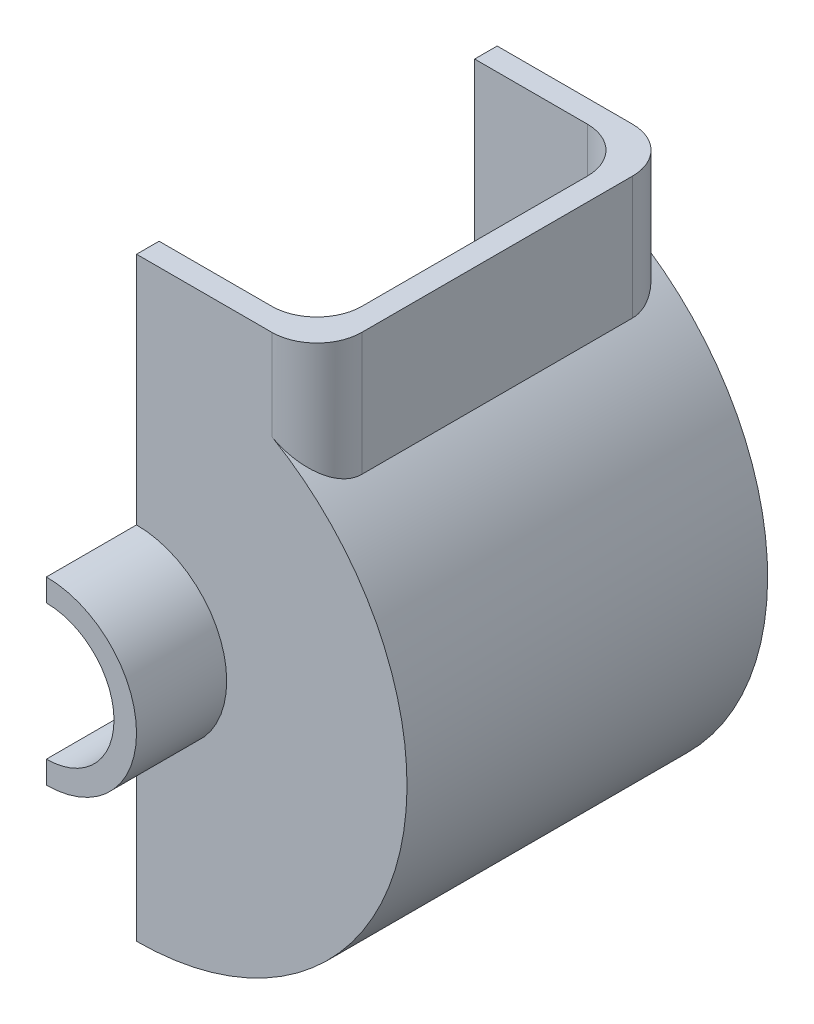
ISO-10303-21;
HEADER;
FILE_DESCRIPTION(('STEP AP214'),'2;1');
FILE_NAME('part.step','',(''),(''),'','','');
FILE_SCHEMA(('AUTOMOTIVE_DESIGN { 1 0 10303 214 1 1 1 1 }'));
ENDSEC;
DATA;
#1=APPLICATION_CONTEXT('core data for automotive mechanical design processes');
#2=APPLICATION_PROTOCOL_DEFINITION('international standard','automotive_design',2000,#1);
#3=PRODUCT_CONTEXT('',#1,'mechanical');
#4=PRODUCT('Part','Part','',(#3));
#5=PRODUCT_RELATED_PRODUCT_CATEGORY('part','',(#4));
#6=PRODUCT_DEFINITION_FORMATION('','',#4);
#7=PRODUCT_DEFINITION_CONTEXT('part definition',#1,'design');
#8=PRODUCT_DEFINITION('design','',#6,#7);
#9=PRODUCT_DEFINITION_SHAPE('','',#8);
#10=(LENGTH_UNIT() NAMED_UNIT(*) SI_UNIT(.MILLI.,.METRE.));
#11=(NAMED_UNIT(*) PLANE_ANGLE_UNIT() SI_UNIT($,.RADIAN.));
#12=(NAMED_UNIT(*) SI_UNIT($,.STERADIAN.) SOLID_ANGLE_UNIT());
#13=UNCERTAINTY_MEASURE_WITH_UNIT(LENGTH_MEASURE(1.E-05),#10,'distance_accuracy_value','');
#14=(GEOMETRIC_REPRESENTATION_CONTEXT(3) GLOBAL_UNCERTAINTY_ASSIGNED_CONTEXT((#13)) GLOBAL_UNIT_ASSIGNED_CONTEXT((#10,
#11,#12)) REPRESENTATION_CONTEXT('',''));
#15=CARTESIAN_POINT('',(0.,0.,0.));
#16=DIRECTION('',(0.,0.,1.));
#17=DIRECTION('',(1.,0.,0.));
#18=AXIS2_PLACEMENT_3D('',#15,#16,#17);
#19=CARTESIAN_POINT('',(0.,0.,0.));
#20=DIRECTION('',(0.,0.,1.));
#21=DIRECTION('',(1.,0.,0.));
#22=AXIS2_PLACEMENT_3D('',#19,#20,#21);
#23=PLANE('',#22);
#24=DIRECTION('',(-1.,0.,0.));
#25=VECTOR('',#24,1.);
#26=CARTESIAN_POINT('',(40.,72.,0.));
#27=LINE('',#26,#25);
#28=CARTESIAN_POINT('',(25.,72.,0.));
#29=VERTEX_POINT('',#28);
#30=CARTESIAN_POINT('',(0.,72.,0.));
#31=VERTEX_POINT('',#30);
#32=EDGE_CURVE('E268',#29,#31,#27,.T.);
#33=ORIENTED_EDGE('',*,*,#32,.F.);
#34=DIRECTION('',(0.,1.,0.));
#35=VECTOR('',#34,1.);
#36=CARTESIAN_POINT('',(25.,42.4264068711928,0.));
#37=LINE('',#36,#35);
#38=CARTESIAN_POINT('',(25.,48.9897948556636,0.));
#39=VERTEX_POINT('',#38);
#40=EDGE_CURVE('E361',#29,#39,#37,.F.);
#41=ORIENTED_EDGE('',*,*,#40,.T.);
#42=CARTESIAN_POINT('',(0.,0.,0.));
#43=DIRECTION('',(0.,0.,1.));
#44=DIRECTION('',(1.,0.,0.));
#45=AXIS2_PLACEMENT_3D('',#42,#43,#44);
#46=CIRCLE('',#45,55.);
#47=CARTESIAN_POINT('',(0.,-55.,0.));
#48=VERTEX_POINT('',#47);
#49=EDGE_CURVE('E265',#48,#39,#46,.T.);
#50=ORIENTED_EDGE('',*,*,#49,.F.);
#51=DIRECTION('',(0.,-1.,0.));
#52=VECTOR('',#51,1.);
#53=CARTESIAN_POINT('',(0.,-20.,0.));
#54=LINE('',#53,#52);
#55=CARTESIAN_POINT('',(0.,-15.,0.));
#56=VERTEX_POINT('',#55);
#57=EDGE_CURVE('E322',#56,#48,#54,.T.);
#58=ORIENTED_EDGE('',*,*,#57,.F.);
#59=CARTESIAN_POINT('',(0.,0.,0.));
#60=DIRECTION('',(0.,0.,-1.));
#61=DIRECTION('',(1.,0.,0.));
#62=AXIS2_PLACEMENT_3D('',#59,#60,#61);
#63=CIRCLE('',#62,15.);
#64=CARTESIAN_POINT('',(0.,15.,0.));
#65=VERTEX_POINT('',#64);
#66=EDGE_CURVE('E334',#65,#56,#63,.T.);
#67=ORIENTED_EDGE('',*,*,#66,.F.);
#68=DIRECTION('',(0.,-1.,0.));
#69=VECTOR('',#68,1.);
#70=CARTESIAN_POINT('',(0.,15.,0.));
#71=LINE('',#70,#69);
#72=EDGE_CURVE('E316',#31,#65,#71,.T.);
#73=ORIENTED_EDGE('',*,*,#72,.F.);
#74=EDGE_LOOP('',(#33,#41,#50,#58,#67,#73));
#75=FACE_BOUND('',#74,.T.);
#76=ADVANCED_FACE('F45',(#75),#23,.F.);
#77=CARTESIAN_POINT('',(0.,0.,25.));
#78=DIRECTION('',(0.,0.,-1.));
#79=DIRECTION('',(-1.,0.,0.));
#80=AXIS2_PLACEMENT_3D('',#77,#78,#79);
#81=CYLINDRICAL_SURFACE('',#80,20.);
#82=DIRECTION('',(0.,0.,-1.));
#83=VECTOR('',#82,1.);
#84=CARTESIAN_POINT('',(0.,-20.,25.));
#85=LINE('',#84,#83);
#86=CARTESIAN_POINT('',(0.,-20.,25.));
#87=VERTEX_POINT('',#86);
#88=CARTESIAN_POINT('',(0.,-20.,5.));
#89=VERTEX_POINT('',#88);
#90=EDGE_CURVE('E331',#87,#89,#85,.T.);
#91=ORIENTED_EDGE('',*,*,#90,.T.);
#92=CARTESIAN_POINT('',(0.,0.,5.));
#93=DIRECTION('',(0.,0.,-1.));
#94=DIRECTION('',(1.,0.,0.));
#95=AXIS2_PLACEMENT_3D('',#92,#93,#94);
#96=CIRCLE('',#95,20.);
#97=CARTESIAN_POINT('',(0.,20.,5.));
#98=VERTEX_POINT('',#97);
#99=EDGE_CURVE('E293',#98,#89,#96,.T.);
#100=ORIENTED_EDGE('',*,*,#99,.F.);
#101=DIRECTION('',(0.,0.,-1.));
#102=VECTOR('',#101,1.);
#103=CARTESIAN_POINT('',(0.,20.,25.));
#104=LINE('',#103,#102);
#105=CARTESIAN_POINT('',(0.,20.,25.));
#106=VERTEX_POINT('',#105);
#107=EDGE_CURVE('E350',#106,#98,#104,.T.);
#108=ORIENTED_EDGE('',*,*,#107,.F.);
#109=CARTESIAN_POINT('',(0.,0.,25.));
#110=DIRECTION('',(0.,0.,1.));
#111=DIRECTION('',(1.,0.,0.));
#112=AXIS2_PLACEMENT_3D('',#109,#110,#111);
#113=CIRCLE('',#112,20.);
#114=EDGE_CURVE('E317',#87,#106,#113,.T.);
#115=ORIENTED_EDGE('',*,*,#114,.F.);
#116=EDGE_LOOP('',(#91,#100,#108,#115));
#117=FACE_BOUND('',#116,.T.);
#118=ADVANCED_FACE('F414',(#117),#81,.T.);
#119=CARTESIAN_POINT('',(0.,15.,25.));
#120=DIRECTION('',(1.,0.,0.));
#121=DIRECTION('',(0.,0.,-1.));
#122=AXIS2_PLACEMENT_3D('',#119,#120,#121);
#123=PLANE('',#122);
#124=ORIENTED_EDGE('',*,*,#72,.T.);
#125=DIRECTION('',(0.,0.,-1.));
#126=VECTOR('',#125,1.);
#127=CARTESIAN_POINT('',(0.,15.,25.));
#128=LINE('',#127,#126);
#129=CARTESIAN_POINT('',(0.,15.,25.));
#130=VERTEX_POINT('',#129);
#131=EDGE_CURVE('E346',#130,#65,#128,.T.);
#132=ORIENTED_EDGE('',*,*,#131,.F.);
#133=DIRECTION('',(0.,-1.,0.));
#134=VECTOR('',#133,1.);
#135=CARTESIAN_POINT('',(0.,15.,25.));
#136=LINE('',#135,#134);
#137=EDGE_CURVE('E321',#106,#130,#136,.T.);
#138=ORIENTED_EDGE('',*,*,#137,.F.);
#139=ORIENTED_EDGE('',*,*,#107,.T.);
#140=DIRECTION('',(0.,-1.,0.));
#141=VECTOR('',#140,1.);
#142=CARTESIAN_POINT('',(0.,72.,5.));
#143=LINE('',#142,#141);
#144=CARTESIAN_POINT('',(0.,72.,5.));
#145=VERTEX_POINT('',#144);
#146=EDGE_CURVE('E289',#145,#98,#143,.T.);
#147=ORIENTED_EDGE('',*,*,#146,.F.);
#148=DIRECTION('',(0.,0.,-1.));
#149=VECTOR('',#148,1.);
#150=CARTESIAN_POINT('',(0.,72.,5.));
#151=LINE('',#150,#149);
#152=EDGE_CURVE('E305',#145,#31,#151,.T.);
#153=ORIENTED_EDGE('',*,*,#152,.T.);
#154=EDGE_LOOP('',(#124,#132,#138,#139,#147,#153));
#155=FACE_BOUND('',#154,.T.);
#156=ADVANCED_FACE('F455',(#155),#123,.F.);
#157=CARTESIAN_POINT('',(0.,0.,25.));
#158=DIRECTION('',(0.,0.,-1.));
#159=DIRECTION('',(-1.,0.,0.));
#160=AXIS2_PLACEMENT_3D('',#157,#158,#159);
#161=CYLINDRICAL_SURFACE('',#160,15.);
#162=ORIENTED_EDGE('',*,*,#66,.T.);
#163=DIRECTION('',(0.,0.,-1.));
#164=VECTOR('',#163,1.);
#165=CARTESIAN_POINT('',(0.,-15.,25.));
#166=LINE('',#165,#164);
#167=CARTESIAN_POINT('',(0.,-15.,25.));
#168=VERTEX_POINT('',#167);
#169=EDGE_CURVE('E342',#168,#56,#166,.T.);
#170=ORIENTED_EDGE('',*,*,#169,.F.);
#171=CARTESIAN_POINT('',(0.,0.,25.));
#172=DIRECTION('',(0.,0.,-1.));
#173=DIRECTION('',(1.,0.,0.));
#174=AXIS2_PLACEMENT_3D('',#171,#172,#173);
#175=CIRCLE('',#174,15.);
#176=EDGE_CURVE('E325',#130,#168,#175,.T.);
#177=ORIENTED_EDGE('',*,*,#176,.F.);
#178=ORIENTED_EDGE('',*,*,#131,.T.);
#179=EDGE_LOOP('',(#162,#170,#177,#178));
#180=FACE_BOUND('',#179,.T.);
#181=ADVANCED_FACE('F452',(#180),#161,.F.);
#182=CARTESIAN_POINT('',(0.,-20.,25.));
#183=DIRECTION('',(1.,0.,0.));
#184=DIRECTION('',(0.,0.,-1.));
#185=AXIS2_PLACEMENT_3D('',#182,#183,#184);
#186=PLANE('',#185);
#187=ORIENTED_EDGE('',*,*,#57,.T.);
#188=DIRECTION('',(0.,0.,1.));
#189=VECTOR('',#188,1.);
#190=CARTESIAN_POINT('',(0.,-55.,-75.002));
#191=LINE('',#190,#189);
#192=CARTESIAN_POINT('',(0.,-55.,-70.));
#193=VERTEX_POINT('',#192);
#194=EDGE_CURVE('E269',#193,#48,#191,.T.);
#195=ORIENTED_EDGE('',*,*,#194,.F.);
#196=DIRECTION('',(0.,-1.,0.));
#197=VECTOR('',#196,1.);
#198=CARTESIAN_POINT('',(0.,-20.,-70.));
#199=LINE('',#198,#197);
#200=CARTESIAN_POINT('',(0.,-15.,-70.));
#201=VERTEX_POINT('',#200);
#202=EDGE_CURVE('E240',#201,#193,#199,.T.);
#203=ORIENTED_EDGE('',*,*,#202,.F.);
#204=DIRECTION('',(0.,0.,1.));
#205=VECTOR('',#204,1.);
#206=CARTESIAN_POINT('',(0.,-15.,-95.));
#207=LINE('',#206,#205);
#208=CARTESIAN_POINT('',(0.,-15.,-95.));
#209=VERTEX_POINT('',#208);
#210=EDGE_CURVE('E231',#209,#201,#207,.T.);
#211=ORIENTED_EDGE('',*,*,#210,.F.);
#212=DIRECTION('',(0.,-1.,0.));
#213=VECTOR('',#212,1.);
#214=CARTESIAN_POINT('',(0.,-20.,-95.));
#215=LINE('',#214,#213);
#216=CARTESIAN_POINT('',(0.,-20.,-95.));
#217=VERTEX_POINT('',#216);
#218=EDGE_CURVE('E226',#209,#217,#215,.T.);
#219=ORIENTED_EDGE('',*,*,#218,.T.);
#220=DIRECTION('',(0.,0.,1.));
#221=VECTOR('',#220,1.);
#222=CARTESIAN_POINT('',(0.,-20.,-95.));
#223=LINE('',#222,#221);
#224=CARTESIAN_POINT('',(0.,-20.,-75.));
#225=VERTEX_POINT('',#224);
#226=EDGE_CURVE('E216',#217,#225,#223,.T.);
#227=ORIENTED_EDGE('',*,*,#226,.T.);
#228=DIRECTION('',(0.,-1.,0.));
#229=VECTOR('',#228,1.);
#230=CARTESIAN_POINT('',(0.,-20.,-75.));
#231=LINE('',#230,#229);
#232=CARTESIAN_POINT('',(0.,-60.,-75.));
#233=VERTEX_POINT('',#232);
#234=EDGE_CURVE('E248',#225,#233,#231,.T.);
#235=ORIENTED_EDGE('',*,*,#234,.T.);
#236=DIRECTION('',(0.,0.,-1.));
#237=VECTOR('',#236,1.);
#238=CARTESIAN_POINT('',(0.,-60.,5.));
#239=LINE('',#238,#237);
#240=CARTESIAN_POINT('',(0.,-60.,5.));
#241=VERTEX_POINT('',#240);
#242=EDGE_CURVE('E300',#241,#233,#239,.T.);
#243=ORIENTED_EDGE('',*,*,#242,.F.);
#244=DIRECTION('',(0.,-1.,0.));
#245=VECTOR('',#244,1.);
#246=CARTESIAN_POINT('',(0.,-20.,5.));
#247=LINE('',#246,#245);
#248=EDGE_CURVE('E297',#89,#241,#247,.T.);
#249=ORIENTED_EDGE('',*,*,#248,.F.);
#250=ORIENTED_EDGE('',*,*,#90,.F.);
#251=DIRECTION('',(0.,-1.,0.));
#252=VECTOR('',#251,1.);
#253=CARTESIAN_POINT('',(0.,-20.,25.));
#254=LINE('',#253,#252);
#255=EDGE_CURVE('E328',#168,#87,#254,.T.);
#256=ORIENTED_EDGE('',*,*,#255,.F.);
#257=ORIENTED_EDGE('',*,*,#169,.T.);
#258=EDGE_LOOP('',(#187,#195,#203,#211,#219,#227,#235,#243,#249,#250,#256,#257));
#259=FACE_BOUND('',#258,.T.);
#260=ADVANCED_FACE('F445',(#259),#186,.F.);
#261=CARTESIAN_POINT('',(0.,0.,25.));
#262=DIRECTION('',(0.,0.,1.));
#263=DIRECTION('',(1.,0.,0.));
#264=AXIS2_PLACEMENT_3D('',#261,#262,#263);
#265=PLANE('',#264);
#266=ORIENTED_EDGE('',*,*,#114,.T.);
#267=ORIENTED_EDGE('',*,*,#137,.T.);
#268=ORIENTED_EDGE('',*,*,#176,.T.);
#269=ORIENTED_EDGE('',*,*,#255,.T.);
#270=EDGE_LOOP('',(#266,#267,#268,#269));
#271=FACE_BOUND('',#270,.T.);
#272=ADVANCED_FACE('F440',(#271),#265,.T.);
#273=CARTESIAN_POINT('',(0.,0.,5.));
#274=DIRECTION('',(0.,0.,-1.));
#275=DIRECTION('',(-1.,0.,0.));
#276=AXIS2_PLACEMENT_3D('',#273,#274,#275);
#277=CYLINDRICAL_SURFACE('',#276,60.);
#278=ORIENTED_EDGE('',*,*,#242,.T.);
#279=CARTESIAN_POINT('',(0.,0.,-75.));
#280=DIRECTION('',(0.,0.,1.));
#281=DIRECTION('',(1.,0.,0.));
#282=AXIS2_PLACEMENT_3D('',#279,#280,#281);
#283=CIRCLE('',#282,60.);
#284=CARTESIAN_POINT('',(30.,51.9615242270663,-75.));
#285=VERTEX_POINT('',#284);
#286=EDGE_CURVE('E66',#233,#285,#283,.T.);
#287=ORIENTED_EDGE('',*,*,#286,.T.);
#288=CARTESIAN_POINT('',(30.,51.9615242270663,-75.));
#289=CARTESIAN_POINT('',(30.1846403402756,51.8549243575684,-74.9999969446745));
#290=CARTESIAN_POINT('',(30.3686755821332,51.7473565843307,-74.9948858781263));
#291=CARTESIAN_POINT('',(30.7351668388072,51.5305231450817,-74.9746291862722));
#292=CARTESIAN_POINT('',(30.9176229894396,51.4212576273974,-74.9594844328199));
#293=CARTESIAN_POINT('',(31.4619253243051,51.0913595980358,-74.8992916720064));
#294=CARTESIAN_POINT('',(31.8209014856786,50.868512343648,-74.8394847724551));
#295=CARTESIAN_POINT('',(32.5288887310146,50.418725257113,-74.6817684192746));
#296=CARTESIAN_POINT('',(32.8778736192083,50.1917768316845,-74.5837671788936));
#297=CARTESIAN_POINT('',(33.562476910193,49.7365966241752,-74.3509069689393));
#298=CARTESIAN_POINT('',(33.8980954977704,49.5083648598862,-74.2160485091123));
#299=CARTESIAN_POINT('',(34.5207296024579,49.0759439346811,-73.9257453447207));
#300=CARTESIAN_POINT('',(34.8092512536601,48.8716304811259,-73.7737026717613));
#301=CARTESIAN_POINT('',(35.3716903107987,48.4661085573826,-73.4410708922834));
#302=CARTESIAN_POINT('',(35.6456079007732,48.2649000480893,-73.2604821456118));
#303=CARTESIAN_POINT('',(36.1765727574088,47.8682074936152,-72.8713511230921));
#304=CARTESIAN_POINT('',(36.4336405194033,47.6727166603459,-72.6628437825717));
#305=CARTESIAN_POINT('',(36.9290721152615,47.289972828363,-72.2179462189915));
#306=CARTESIAN_POINT('',(37.167441451851,47.1027174132442,-71.9815642507562));
#307=CARTESIAN_POINT('',(37.565018182153,46.785859634165,-71.5447814640329));
#308=CARTESIAN_POINT('',(37.7289458526818,46.6537017113221,-71.3505083317644));
#309=CARTESIAN_POINT('',(38.043765038696,46.397339573439,-70.9467105058367));
#310=CARTESIAN_POINT('',(38.1946575996422,46.2731347207424,-70.7371870377955));
#311=CARTESIAN_POINT('',(38.4818360085844,46.0345861261904,-70.3033999485107));
#312=CARTESIAN_POINT('',(38.618136880254,45.9202322658759,-70.0791518792914));
#313=CARTESIAN_POINT('',(38.8746918035924,45.7032445431668,-69.616256552183));
#314=CARTESIAN_POINT('',(38.9949492411763,45.6006082084878,-69.3776123480399));
#315=CARTESIAN_POINT('',(39.1965662504922,45.4273417305266,-68.9333059736579));
#316=CARTESIAN_POINT('',(39.2809795718102,45.3543309967536,-68.7299541806998));
#317=CARTESIAN_POINT('',(39.437114382813,45.2186323209963,-68.3151120867855));
#318=CARTESIAN_POINT('',(39.508838494378,45.1559422467147,-68.1036234781017));
#319=CARTESIAN_POINT('',(39.6385128100447,45.0421551914612,-67.6738273638982));
#320=CARTESIAN_POINT('',(39.6964869139818,44.9910381018204,-67.4555324476021));
#321=CARTESIAN_POINT('',(39.7978943535571,44.9013606141582,-67.013147333994));
#322=CARTESIAN_POINT('',(39.8413328734582,44.8627957393971,-66.7890592336639));
#323=CARTESIAN_POINT('',(39.9177189665931,44.7948514731765,-66.3062255717589));
#324=CARTESIAN_POINT('',(39.9484884415043,44.7673886419263,-66.0468508548623));
#325=CARTESIAN_POINT('',(39.9793476433001,44.7398248250479,-65.6555955531587));
#326=CARTESIAN_POINT('',(39.987084921451,44.7329085695169,-65.5247242124793));
#327=CARTESIAN_POINT('',(39.9974129661721,44.7236736235071,-65.262577624008));
#328=CARTESIAN_POINT('',(40.0000021863485,44.7213563144782,-65.1313022667122));
#329=CARTESIAN_POINT('',(40.,44.7213595499958,-65.));
#330=B_SPLINE_CURVE_WITH_KNOTS('',3,(#288,#289,#290,#291,#292,#293,#294,#295,#296,#297,#298,
#299,#300,#301,#302,#303,#304,#305,#306,#307,#308,#309,#310,#311,#312,#313,#314,#315,#316,#317,
#318,#319,#320,#321,#322,#323,#324,#325,#326,#327,#328,#329),.UNSPECIFIED.,.F.,.F.,(4,2,2,2,2,2,
2,2,2,2,2,2,2,2,2,2,2,2,2,2,4),(0.,0.639469988122812,1.27888441829631,2.55703672344089,
3.83827975129429,5.11950506007104,6.27274736359202,7.42597513070352,8.57777308710981,
9.72923080131074,10.5879927572485,11.4466857734357,12.304485995346,13.1621048939207,
13.8573439066469,14.5524390989254,15.2463170957639,15.9399473495784,16.7262834977137,
17.1199731890566,17.5137811205932),.UNSPECIFIED.);
#331=CARTESIAN_POINT('',(40.,44.7213595499958,-65.));
#332=VERTEX_POINT('',#331);
#333=EDGE_CURVE('E11',#285,#332,#330,.T.);
#334=ORIENTED_EDGE('',*,*,#333,.T.);
#335=DIRECTION('',(0.,0.,-1.));
#336=VECTOR('',#335,1.);
#337=CARTESIAN_POINT('',(40.,44.7213595499958,5.));
#338=LINE('',#337,#336);
#339=CARTESIAN_POINT('',(40.,44.7213595499958,-5.));
#340=VERTEX_POINT('',#339);
#341=EDGE_CURVE('E313',#340,#332,#338,.T.);
#342=ORIENTED_EDGE('',*,*,#341,.F.);
#343=CARTESIAN_POINT('',(40.,44.7213595499958,-5.));
#344=CARTESIAN_POINT('',(40.0000015812733,44.7213573011344,-4.88233659899795));
#345=CARTESIAN_POINT('',(39.9979227141808,44.7232176305845,-4.76469134501435));
#346=CARTESIAN_POINT('',(39.9896253110866,44.7306372942271,-4.52967139834014));
#347=CARTESIAN_POINT('',(39.9834070494192,44.7361963832882,-4.41229668823677));
#348=CARTESIAN_POINT('',(39.9585923280535,44.7583670958171,-4.06115725324137));
#349=CARTESIAN_POINT('',(39.9338358355778,44.7804722797486,-3.82812419453978));
#350=CARTESIAN_POINT('',(39.8686644525486,44.8385042167555,-3.3681308673511));
#351=CARTESIAN_POINT('',(39.8283855148164,44.8743109465834,-3.14113567762635));
#352=CARTESIAN_POINT('',(39.7328892662281,44.9588875680342,-2.6927475520883));
#353=CARTESIAN_POINT('',(39.6776696039361,45.0076595001554,-2.47135550412446));
#354=CARTESIAN_POINT('',(39.5534118644793,45.116897250534,-2.03633113502657));
#355=CARTESIAN_POINT('',(39.4844211995899,45.1773229225701,-1.82267508211467));
#356=CARTESIAN_POINT('',(39.3334605195833,45.3088170177995,-1.40330634573547));
#357=CARTESIAN_POINT('',(39.2514857085459,45.3798893730022,-1.19759663244772));
#358=CARTESIAN_POINT('',(39.0753863002098,45.5316122169457,-0.794547062263093));
#359=CARTESIAN_POINT('',(38.9812363061758,45.6122826978885,-0.597225879967647));
#360=CARTESIAN_POINT('',(38.7818943790383,45.7818938454653,-0.211953250104053));
#361=CARTESIAN_POINT('',(38.6767013504078,45.8708353325264,-0.0240027348884372));
#362=CARTESIAN_POINT('',(38.4135728743112,46.0916172160901,0.412907048326735));
#363=CARTESIAN_POINT('',(38.2509572804995,46.2267600621542,0.657396797582136));
#364=CARTESIAN_POINT('',(37.908447036405,46.5080507377658,1.12706976336221));
#365=CARTESIAN_POINT('',(37.7285517130429,46.6541989959475,1.35225222718341));
#366=CARTESIAN_POINT('',(37.3531054007839,46.9553345195759,1.78333374269895));
#367=CARTESIAN_POINT('',(37.1575367002328,47.1103317262239,1.98921039139725));
#368=CARTESIAN_POINT('',(36.7525951751676,47.4269223387039,2.3811838692743));
#369=CARTESIAN_POINT('',(36.5432234671629,47.5885152106185,2.56728229511759));
#370=CARTESIAN_POINT('',(35.889352420626,48.0859277319981,3.10159518157243));
#371=CARTESIAN_POINT('',(35.4251261289153,48.429498559668,3.4189829871174));
#372=CARTESIAN_POINT('',(34.4553726874119,49.1241578823887,3.96997164965975));
#373=CARTESIAN_POINT('',(33.9498747171002,49.4752409388269,4.20363108426691));
#374=CARTESIAN_POINT('',(33.1568278633415,50.0073212539565,4.49304568786428));
#375=CARTESIAN_POINT('',(32.8810021018505,50.1891501210001,4.58038196656831));
#376=CARTESIAN_POINT('',(32.3217375725054,50.5511235483305,4.7310524671282));
#377=CARTESIAN_POINT('',(32.0382991780871,50.7312681906542,4.79438786404663));
#378=CARTESIAN_POINT('',(31.4650006560554,51.0888227050653,4.89639399785259));
#379=CARTESIAN_POINT('',(31.1751356203563,51.2662302982853,4.93504516116603));
#380=CARTESIAN_POINT('',(30.5906934832528,51.6171131325133,4.98684851371051));
#381=CARTESIAN_POINT('',(30.2961152167169,51.7905873747387,4.99999429654889));
#382=CARTESIAN_POINT('',(30.,51.9615242270663,5.));
#383=B_SPLINE_CURVE_WITH_KNOTS('',3,(#343,#344,#345,#346,#347,#348,#349,#350,#351,#352,#353,
#354,#355,#356,#357,#358,#359,#360,#361,#362,#363,#364,#365,#366,#367,#368,#369,#370,#371,#372,
#373,#374,#375,#376,#377,#378,#379,#380,#381,#382),.UNSPECIFIED.,.F.,.F.,(4,2,2,2,2,2,2,2,2,2,2,
2,2,2,2,2,2,2,2,4),(0.,0.352921378883198,0.705819370583169,1.4108593212863,2.10985961734753,
2.80896998914977,3.50571366437717,4.20271529673453,4.90119502233959,5.59974410640155,
6.56805788163331,7.536409389878,8.50587104319846,9.47525437387455,11.4447404103531,
13.4128458625583,14.4372042618812,15.4615125030147,16.4866319729198,17.5120088970542),.UNSPECIFIED.);
#384=CARTESIAN_POINT('',(30.,51.9615242270663,5.));
#385=VERTEX_POINT('',#384);
#386=EDGE_CURVE('E60',#340,#385,#383,.T.);
#387=ORIENTED_EDGE('',*,*,#386,.T.);
#388=CARTESIAN_POINT('',(0.,0.,5.));
#389=DIRECTION('',(0.,0.,1.));
#390=DIRECTION('',(1.,0.,0.));
#391=AXIS2_PLACEMENT_3D('',#388,#389,#390);
#392=CIRCLE('',#391,60.);
#393=EDGE_CURVE('E283',#241,#385,#392,.T.);
#394=ORIENTED_EDGE('',*,*,#393,.F.);
#395=EDGE_LOOP('',(#278,#287,#334,#342,#387,#394));
#396=FACE_BOUND('',#395,.T.);
#397=ADVANCED_FACE('F434',(#396),#277,.T.);
#398=CARTESIAN_POINT('',(40.,44.7213595499958,5.));
#399=DIRECTION('',(-1.,0.,0.));
#400=DIRECTION('',(0.,0.,1.));
#401=AXIS2_PLACEMENT_3D('',#398,#399,#400);
#402=PLANE('',#401);
#403=DIRECTION('',(0.,0.,-1.));
#404=VECTOR('',#403,1.);
#405=CARTESIAN_POINT('',(40.,72.,5.));
#406=LINE('',#405,#404);
#407=CARTESIAN_POINT('',(40.,72.,-5.));
#408=VERTEX_POINT('',#407);
#409=CARTESIAN_POINT('',(40.,72.,-65.));
#410=VERTEX_POINT('',#409);
#411=EDGE_CURVE('E309',#408,#410,#406,.T.);
#412=ORIENTED_EDGE('',*,*,#411,.F.);
#413=DIRECTION('',(0.,1.,0.));
#414=VECTOR('',#413,1.);
#415=CARTESIAN_POINT('',(40.,44.7213595499958,-5.));
#416=LINE('',#415,#414);
#417=EDGE_CURVE('E383',#408,#340,#416,.F.);
#418=ORIENTED_EDGE('',*,*,#417,.T.);
#419=ORIENTED_EDGE('',*,*,#341,.T.);
#420=DIRECTION('',(0.,1.,0.));
#421=VECTOR('',#420,1.);
#422=CARTESIAN_POINT('',(40.,72.,-65.));
#423=LINE('',#422,#421);
#424=EDGE_CURVE('E379',#332,#410,#423,.T.);
#425=ORIENTED_EDGE('',*,*,#424,.T.);
#426=EDGE_LOOP('',(#412,#418,#419,#425));
#427=FACE_BOUND('',#426,.T.);
#428=ADVANCED_FACE('F439',(#427),#402,.F.);
#429=CARTESIAN_POINT('',(40.,72.,5.));
#430=DIRECTION('',(0.,-1.,0.));
#431=DIRECTION('',(0.,0.,-1.));
#432=AXIS2_PLACEMENT_3D('',#429,#430,#431);
#433=PLANE('',#432);
#434=DIRECTION('',(-1.,0.,0.));
#435=VECTOR('',#434,1.);
#436=CARTESIAN_POINT('',(40.,72.,5.));
#437=LINE('',#436,#435);
#438=CARTESIAN_POINT('',(30.,72.,5.));
#439=VERTEX_POINT('',#438);
#440=EDGE_CURVE('E286',#439,#145,#437,.T.);
#441=ORIENTED_EDGE('',*,*,#440,.F.);
#442=CARTESIAN_POINT('',(30.,72.,-5.));
#443=DIRECTION('',(0.,-1.,0.));
#444=DIRECTION('',(0.,0.,-1.));
#445=AXIS2_PLACEMENT_3D('',#442,#443,#444);
#446=CIRCLE('',#445,10.);
#447=EDGE_CURVE('E376',#439,#408,#446,.F.);
#448=ORIENTED_EDGE('',*,*,#447,.T.);
#449=ORIENTED_EDGE('',*,*,#411,.T.);
#450=CARTESIAN_POINT('',(30.,72.,-65.));
#451=DIRECTION('',(0.,-1.,0.));
#452=DIRECTION('',(0.,0.,-1.));
#453=AXIS2_PLACEMENT_3D('',#450,#451,#452);
#454=CIRCLE('',#453,10.);
#455=CARTESIAN_POINT('',(30.,72.,-75.));
#456=VERTEX_POINT('',#455);
#457=EDGE_CURVE('E373',#410,#456,#454,.F.);
#458=ORIENTED_EDGE('',*,*,#457,.T.);
#459=DIRECTION('',(-1.,0.,0.));
#460=VECTOR('',#459,1.);
#461=CARTESIAN_POINT('',(40.,72.,-75.));
#462=LINE('',#461,#460);
#463=CARTESIAN_POINT('',(0.,72.,-75.));
#464=VERTEX_POINT('',#463);
#465=EDGE_CURVE('E239',#456,#464,#462,.T.);
#466=ORIENTED_EDGE('',*,*,#465,.T.);
#467=DIRECTION('',(0.,0.,1.));
#468=VECTOR('',#467,1.);
#469=CARTESIAN_POINT('',(0.,72.,-75.));
#470=LINE('',#469,#468);
#471=CARTESIAN_POINT('',(0.,72.,-70.));
#472=VERTEX_POINT('',#471);
#473=EDGE_CURVE('E252',#464,#472,#470,.T.);
#474=ORIENTED_EDGE('',*,*,#473,.T.);
#475=DIRECTION('',(-1.,0.,0.));
#476=VECTOR('',#475,1.);
#477=CARTESIAN_POINT('',(40.,72.,-70.));
#478=LINE('',#477,#476);
#479=CARTESIAN_POINT('',(25.,72.,-70.));
#480=VERTEX_POINT('',#479);
#481=EDGE_CURVE('E211',#480,#472,#478,.T.);
#482=ORIENTED_EDGE('',*,*,#481,.F.);
#483=CARTESIAN_POINT('',(25.,72.,-60.));
#484=DIRECTION('',(0.,-1.,0.));
#485=DIRECTION('',(0.,0.,-1.));
#486=AXIS2_PLACEMENT_3D('',#483,#484,#485);
#487=CIRCLE('',#486,10.);
#488=CARTESIAN_POINT('',(35.,72.,-60.));
#489=VERTEX_POINT('',#488);
#490=EDGE_CURVE('E401',#480,#489,#487,.T.);
#491=ORIENTED_EDGE('',*,*,#490,.T.);
#492=DIRECTION('',(0.,0.,1.));
#493=VECTOR('',#492,1.);
#494=CARTESIAN_POINT('',(35.,72.,-75.002));
#495=LINE('',#494,#493);
#496=CARTESIAN_POINT('',(35.,72.,-9.99999999999999));
#497=VERTEX_POINT('',#496);
#498=EDGE_CURVE('E270',#489,#497,#495,.T.);
#499=ORIENTED_EDGE('',*,*,#498,.T.);
#500=CARTESIAN_POINT('',(25.,72.,-9.99999999999999));
#501=DIRECTION('',(0.,-1.,0.));
#502=DIRECTION('',(0.,0.,-1.));
#503=AXIS2_PLACEMENT_3D('',#500,#501,#502);
#504=CIRCLE('',#503,10.);
#505=EDGE_CURVE('E389',#497,#29,#504,.T.);
#506=ORIENTED_EDGE('',*,*,#505,.T.);
#507=ORIENTED_EDGE('',*,*,#32,.T.);
#508=ORIENTED_EDGE('',*,*,#152,.F.);
#509=EDGE_LOOP('',(#441,#448,#449,#458,#466,#474,#482,#491,#499,#506,#507,#508));
#510=FACE_BOUND('',#509,.T.);
#511=ADVANCED_FACE('F487',(#510),#433,.F.);
#512=CARTESIAN_POINT('',(0.,0.,5.));
#513=DIRECTION('',(0.,0.,1.));
#514=DIRECTION('',(1.,0.,0.));
#515=AXIS2_PLACEMENT_3D('',#512,#513,#514);
#516=PLANE('',#515);
#517=ORIENTED_EDGE('',*,*,#393,.T.);
#518=DIRECTION('',(0.,1.,0.));
#519=VECTOR('',#518,1.);
#520=CARTESIAN_POINT('',(30.,72.,5.));
#521=LINE('',#520,#519);
#522=EDGE_CURVE('E369',#385,#439,#521,.T.);
#523=ORIENTED_EDGE('',*,*,#522,.T.);
#524=ORIENTED_EDGE('',*,*,#440,.T.);
#525=ORIENTED_EDGE('',*,*,#146,.T.);
#526=ORIENTED_EDGE('',*,*,#99,.T.);
#527=ORIENTED_EDGE('',*,*,#248,.T.);
#528=EDGE_LOOP('',(#517,#523,#524,#525,#526,#527));
#529=FACE_BOUND('',#528,.T.);
#530=ADVANCED_FACE('F504',(#529),#516,.T.);
#531=CARTESIAN_POINT('',(35.,44.7213595499958,-75.002));
#532=DIRECTION('',(1.,0.,0.));
#533=DIRECTION('',(0.,0.,-1.));
#534=AXIS2_PLACEMENT_3D('',#531,#532,#533);
#535=PLANE('',#534);
#536=DIRECTION('',(0.,0.,1.));
#537=VECTOR('',#536,1.);
#538=CARTESIAN_POINT('',(35.,42.4264068711928,-75.002));
#539=LINE('',#538,#537);
#540=CARTESIAN_POINT('',(35.,42.4264068711928,-60.));
#541=VERTEX_POINT('',#540);
#542=CARTESIAN_POINT('',(35.,42.4264068711928,-9.99999999999999));
#543=VERTEX_POINT('',#542);
#544=EDGE_CURVE('E274',#541,#543,#539,.T.);
#545=ORIENTED_EDGE('',*,*,#544,.T.);
#546=DIRECTION('',(0.,1.,0.));
#547=VECTOR('',#546,1.);
#548=CARTESIAN_POINT('',(35.,72.,-9.99999999999999));
#549=LINE('',#548,#547);
#550=EDGE_CURVE('E357',#543,#497,#549,.T.);
#551=ORIENTED_EDGE('',*,*,#550,.T.);
#552=ORIENTED_EDGE('',*,*,#498,.F.);
#553=DIRECTION('',(0.,1.,0.));
#554=VECTOR('',#553,1.);
#555=CARTESIAN_POINT('',(35.,42.4264068711928,-60.));
#556=LINE('',#555,#554);
#557=EDGE_CURVE('E354',#489,#541,#556,.F.);
#558=ORIENTED_EDGE('',*,*,#557,.T.);
#559=EDGE_LOOP('',(#545,#551,#552,#558));
#560=FACE_BOUND('',#559,.T.);
#561=ADVANCED_FACE('F512',(#560),#535,.F.);
#562=CARTESIAN_POINT('',(0.,0.,-75.002));
#563=DIRECTION('',(0.,0.,1.));
#564=DIRECTION('',(1.,0.,0.));
#565=AXIS2_PLACEMENT_3D('',#562,#563,#564);
#566=CYLINDRICAL_SURFACE('',#565,55.);
#567=CARTESIAN_POINT('',(0.,0.,-70.));
#568=DIRECTION('',(0.,0.,-1.));
#569=DIRECTION('',(-1.,0.,0.));
#570=AXIS2_PLACEMENT_3D('',#567,#568,#569);
#571=CIRCLE('',#570,55.);
#572=CARTESIAN_POINT('',(25.,48.9897948556636,-70.));
#573=VERTEX_POINT('',#572);
#574=EDGE_CURVE('E264',#193,#573,#571,.F.);
#575=ORIENTED_EDGE('',*,*,#574,.F.);
#576=ORIENTED_EDGE('',*,*,#194,.T.);
#577=ORIENTED_EDGE('',*,*,#49,.T.);
#578=CARTESIAN_POINT('',(25.,48.9897948556636,0.));
#579=CARTESIAN_POINT('',(25.1906704625853,48.8924964907343,-2.83438110608868E-06));
#580=CARTESIAN_POINT('',(25.3807299051036,48.7941008127997,-0.00545379319904846));
#581=CARTESIAN_POINT('',(25.7591946792121,48.5953653194177,-0.0270583342821909));
#582=CARTESIAN_POINT('',(25.947600172291,48.4950256969118,-0.043210859618502));
#583=CARTESIAN_POINT('',(26.5095199627771,48.1915584402701,-0.107406440470387));
#584=CARTESIAN_POINT('',(26.879966617226,47.985865462464,-0.171187973568189));
#585=CARTESIAN_POINT('',(27.6092367230561,47.5700172433392,-0.339146724729518));
#586=CARTESIAN_POINT('',(27.9680515865194,47.3598588865119,-0.443353084701288));
#587=CARTESIAN_POINT('',(28.6708870947942,46.9377053718885,-0.690685682943326));
#588=CARTESIAN_POINT('',(29.0149087495746,46.7257103406777,-0.833809259337719));
#589=CARTESIAN_POINT('',(29.6343122240442,46.3348745882726,-1.13304979004288));
#590=CARTESIAN_POINT('',(29.9121762835488,46.1558947290866,-1.28388072063114));
#591=CARTESIAN_POINT('',(30.453564058984,45.8004938086765,-1.61198448235654));
#592=CARTESIAN_POINT('',(30.7170889667724,45.6240725356816,-1.78925511125295));
#593=CARTESIAN_POINT('',(31.2277793899634,45.27605554075,-2.16954418543659));
#594=CARTESIAN_POINT('',(31.4749603097885,45.1044553652141,-2.37253784443845));
#595=CARTESIAN_POINT('',(31.9512644556701,44.7683103206218,-2.80395081167083));
#596=CARTESIAN_POINT('',(32.1803914213147,44.60376399371,-3.03236483070839));
#597=CARTESIAN_POINT('',(32.5724334975713,44.3179704705643,-3.46360571777399));
#598=CARTESIAN_POINT('',(32.7391594522469,44.1948776144083,-3.66175830234325));
#599=CARTESIAN_POINT('',(33.0586989979014,43.956366411861,-4.07334592184051));
#600=CARTESIAN_POINT('',(33.2115135789464,43.8409475194751,-4.28677986726659));
#601=CARTESIAN_POINT('',(33.5016809731426,43.6196131502262,-4.72827006826885));
#602=CARTESIAN_POINT('',(33.6390478315194,43.5136890586718,-4.95631274037589));
#603=CARTESIAN_POINT('',(33.8968966266417,43.3131282626193,-5.42648122178226));
#604=CARTESIAN_POINT('',(34.0173818752135,43.2184893447453,-5.66860425557722));
#605=CARTESIAN_POINT('',(34.220345560487,43.0578872759332,-6.12240320240193));
#606=CARTESIAN_POINT('',(34.3057864350373,42.9898029979803,-6.33200687059558));
#607=CARTESIAN_POINT('',(34.4630420236251,42.8638412603264,-6.75922491090732));
#608=CARTESIAN_POINT('',(34.534859392632,42.805961812048,-6.97683771230302));
#609=CARTESIAN_POINT('',(34.6638213670323,42.7015968076424,-7.41864114225346));
#610=CARTESIAN_POINT('',(34.7209903361364,42.6550923381947,-7.64282014831901));
#611=CARTESIAN_POINT('',(34.8199345283325,42.5743613090907,-8.09663347290332));
#612=CARTESIAN_POINT('',(34.8617157478199,42.5401299669028,-8.32626562919147));
#613=CARTESIAN_POINT('',(34.9300837462733,42.4840120509156,-8.7954177479703));
#614=CARTESIAN_POINT('',(34.9562545186649,42.4624636500731,-9.03504038452917));
#615=CARTESIAN_POINT('',(34.9824752970613,42.4408592306511,-9.39603092412428));
#616=CARTESIAN_POINT('',(34.9890430057937,42.4354441063026,-9.51665687291809));
#617=CARTESIAN_POINT('',(34.9978062165354,42.4282167617888,-9.75818234209497));
#618=CARTESIAN_POINT('',(35.0000014553635,42.4264047584974,-9.87908187850698));
#619=CARTESIAN_POINT('',(35.,42.4264068711928,-9.99999999999999));
#620=B_SPLINE_CURVE_WITH_KNOTS('',3,(#578,#579,#580,#581,#582,#583,#584,#585,#586,#587,#588,
#589,#590,#591,#592,#593,#594,#595,#596,#597,#598,#599,#600,#601,#602,#603,#604,#605,#606,#607,
#608,#609,#610,#611,#612,#613,#614,#615,#616,#617,#618,#619),.UNSPECIFIED.,.F.,.F.,(4,2,2,2,2,2,
2,2,2,2,2,2,2,2,2,2,2,2,2,2,4),(0.,0.64202515354695,1.28398690760974,2.56714249695266,
3.85122482619341,5.13521934832298,6.22394893506147,7.31258788888126,8.40018571330231,
9.4875576637522,10.3469757139952,11.2063325519534,12.0649016266236,12.9233020310802,
13.6317123054177,14.3399843815419,15.047070674944,15.7538811342204,16.478771552739,
16.8414339261366,17.2041181277167),.UNSPECIFIED.);
#621=EDGE_CURVE('E392',#39,#543,#620,.T.);
#622=ORIENTED_EDGE('',*,*,#621,.T.);
#623=ORIENTED_EDGE('',*,*,#544,.F.);
#624=CARTESIAN_POINT('',(35.,42.4264068711928,-60.));
#625=CARTESIAN_POINT('',(35.0000014497964,42.4264047837681,-60.1201268968428));
#626=CARTESIAN_POINT('',(34.9978348514331,42.4281931348836,-60.2402357728451));
#627=CARTESIAN_POINT('',(34.9891857816154,42.4353263709232,-60.480185086323));
#628=CARTESIAN_POINT('',(34.9827035721487,42.4406710399539,-60.6000255396508));
#629=CARTESIAN_POINT('',(34.956830452997,42.4619893413881,-60.9585821373745));
#630=CARTESIAN_POINT('',(34.9310129679865,42.4832473662838,-61.1965708998591));
#631=CARTESIAN_POINT('',(34.8629816882097,42.5390927002779,-61.6666053959282));
#632=CARTESIAN_POINT('',(34.8208989195309,42.5735734756723,-61.898683211479));
#633=CARTESIAN_POINT('',(34.7210380015034,42.6550543990627,-62.3572187348297));
#634=CARTESIAN_POINT('',(34.6632576605496,42.7020562951679,-62.5836756530505));
#635=CARTESIAN_POINT('',(34.5330883120894,42.807391745231,-63.0288373059527));
#636=CARTESIAN_POINT('',(34.4607440027141,42.865690607765,-63.2475634094605));
#637=CARTESIAN_POINT('',(34.3022805482754,42.9926022625577,-63.676951715178));
#638=CARTESIAN_POINT('',(34.2161564051557,43.061218796573,-63.8876109569817));
#639=CARTESIAN_POINT('',(34.0309660875201,43.2077227263221,-64.3003387827901));
#640=CARTESIAN_POINT('',(33.9318751543174,43.2856278316291,-64.5023899265247));
#641=CARTESIAN_POINT('',(33.7218564369498,43.4494435165853,-64.8968526443819));
#642=CARTESIAN_POINT('',(33.610927467307,43.535354897885,-65.0892632502468));
#643=CARTESIAN_POINT('',(33.3379150398717,43.7449695332966,-65.5287656608816));
#644=CARTESIAN_POINT('',(33.1713989056376,43.87147497144,-65.771783005993));
#645=CARTESIAN_POINT('',(32.820669795309,44.1344729444258,-66.2387847850673));
#646=CARTESIAN_POINT('',(32.6364569574066,44.2709654012783,-66.4627693676298));
#647=CARTESIAN_POINT('',(32.2518815980921,44.5519118289509,-66.8915323780305));
#648=CARTESIAN_POINT('',(32.0515019123395,44.6963742086041,-67.0962898800247));
#649=CARTESIAN_POINT('',(31.6364068995163,44.9911403692426,-67.4859305392089));
#650=CARTESIAN_POINT('',(31.4216926181169,45.1414437238107,-67.6708151435123));
#651=CARTESIAN_POINT('',(30.7527718961723,45.6022087667655,-68.1994610689485));
#652=CARTESIAN_POINT('',(30.2782224789075,45.9192504365907,-68.5123180223924));
#653=CARTESIAN_POINT('',(29.2863950159429,46.5580783691839,-69.0523650813027));
#654=CARTESIAN_POINT('',(28.7691524751348,46.8798605102554,-69.2796255135222));
#655=CARTESIAN_POINT('',(27.9782964577458,47.3529868290528,-69.5500628310771));
#656=CARTESIAN_POINT('',(27.71720700781,47.5063120740257,-69.6276269303824));
#657=CARTESIAN_POINT('',(27.1884092746343,47.8109125009315,-69.7614145337347));
#658=CARTESIAN_POINT('',(26.9207016309538,47.9621878787861,-69.8176400913447));
#659=CARTESIAN_POINT('',(26.379727809034,48.2618435343977,-69.9081593996609));
#660=CARTESIAN_POINT('',(26.1064574293253,48.4102214444596,-69.9424358864451));
#661=CARTESIAN_POINT('',(25.5558838504953,48.703127245693,-69.988359920395));
#662=CARTESIAN_POINT('',(25.2785794886699,48.8476539914468,-70.0000008077378));
#663=CARTESIAN_POINT('',(25.,48.9897948556636,-70.));
#664=B_SPLINE_CURVE_WITH_KNOTS('',3,(#624,#625,#626,#627,#628,#629,#630,#631,#632,#633,#634,
#635,#636,#637,#638,#639,#640,#641,#642,#643,#644,#645,#646,#647,#648,#649,#650,#651,#652,#653,
#654,#655,#656,#657,#658,#659,#660,#661,#662,#663),.UNSPECIFIED.,.F.,.F.,(4,2,2,2,2,2,2,2,2,2,2,
2,2,2,2,2,2,2,2,4),(0.,0.360312293922656,0.720602716369272,1.44047421081294,2.15466369102643,
2.86895293355911,3.58108249267798,4.29347093489963,5.00724001410329,5.72108063834973,
6.68154144938631,7.64199476087037,8.6034815541483,9.56489828596202,11.509617073525,
13.4527345617431,14.3897475989405,15.3266704376779,16.2643293057158,17.2022640090674),.UNSPECIFIED.);
#665=EDGE_CURVE('E421',#541,#573,#664,.T.);
#666=ORIENTED_EDGE('',*,*,#665,.T.);
#667=EDGE_LOOP('',(#575,#576,#577,#622,#623,#666));
#668=FACE_BOUND('',#667,.T.);
#669=ADVANCED_FACE('F403',(#668),#566,.F.);
#670=CARTESIAN_POINT('',(0.,0.,-70.));
#671=DIRECTION('',(0.,0.,-1.));
#672=DIRECTION('',(1.,0.,0.));
#673=AXIS2_PLACEMENT_3D('',#670,#671,#672);
#674=PLANE('',#673);
#675=ORIENTED_EDGE('',*,*,#574,.T.);
#676=DIRECTION('',(0.,1.,0.));
#677=VECTOR('',#676,1.);
#678=CARTESIAN_POINT('',(25.,72.,-70.));
#679=LINE('',#678,#677);
#680=EDGE_CURVE('E365',#573,#480,#679,.T.);
#681=ORIENTED_EDGE('',*,*,#680,.T.);
#682=ORIENTED_EDGE('',*,*,#481,.T.);
#683=DIRECTION('',(0.,-1.,0.));
#684=VECTOR('',#683,1.);
#685=CARTESIAN_POINT('',(0.,20.,-70.));
#686=LINE('',#685,#684);
#687=CARTESIAN_POINT('',(0.,15.,-70.));
#688=VERTEX_POINT('',#687);
#689=EDGE_CURVE('E255',#472,#688,#686,.T.);
#690=ORIENTED_EDGE('',*,*,#689,.T.);
#691=CARTESIAN_POINT('',(0.,0.,-70.));
#692=DIRECTION('',(0.,0.,-1.));
#693=DIRECTION('',(1.,0.,0.));
#694=AXIS2_PLACEMENT_3D('',#691,#692,#693);
#695=CIRCLE('',#694,15.);
#696=EDGE_CURVE('E218',#688,#201,#695,.T.);
#697=ORIENTED_EDGE('',*,*,#696,.T.);
#698=ORIENTED_EDGE('',*,*,#202,.T.);
#699=EDGE_LOOP('',(#675,#681,#682,#690,#697,#698));
#700=FACE_BOUND('',#699,.T.);
#701=ADVANCED_FACE('F479',(#700),#674,.F.);
#702=CARTESIAN_POINT('',(0.,20.,-75.));
#703=DIRECTION('',(1.,0.,0.));
#704=DIRECTION('',(0.,0.,1.));
#705=AXIS2_PLACEMENT_3D('',#702,#703,#704);
#706=PLANE('',#705);
#707=ORIENTED_EDGE('',*,*,#689,.F.);
#708=ORIENTED_EDGE('',*,*,#473,.F.);
#709=DIRECTION('',(0.,-1.,0.));
#710=VECTOR('',#709,1.);
#711=CARTESIAN_POINT('',(0.,72.,-75.));
#712=LINE('',#711,#710);
#713=CARTESIAN_POINT('',(0.,20.,-75.));
#714=VERTEX_POINT('',#713);
#715=EDGE_CURVE('E207',#464,#714,#712,.T.);
#716=ORIENTED_EDGE('',*,*,#715,.T.);
#717=DIRECTION('',(0.,0.,1.));
#718=VECTOR('',#717,1.);
#719=CARTESIAN_POINT('',(0.,20.,-95.));
#720=LINE('',#719,#718);
#721=CARTESIAN_POINT('',(0.,20.,-95.));
#722=VERTEX_POINT('',#721);
#723=EDGE_CURVE('E202',#722,#714,#720,.T.);
#724=ORIENTED_EDGE('',*,*,#723,.F.);
#725=DIRECTION('',(0.,-1.,0.));
#726=VECTOR('',#725,1.);
#727=CARTESIAN_POINT('',(0.,15.,-95.));
#728=LINE('',#727,#726);
#729=CARTESIAN_POINT('',(0.,15.,-95.));
#730=VERTEX_POINT('',#729);
#731=EDGE_CURVE('E187',#722,#730,#728,.T.);
#732=ORIENTED_EDGE('',*,*,#731,.T.);
#733=DIRECTION('',(0.,0.,1.));
#734=VECTOR('',#733,1.);
#735=CARTESIAN_POINT('',(0.,15.,-95.));
#736=LINE('',#735,#734);
#737=EDGE_CURVE('E212',#730,#688,#736,.T.);
#738=ORIENTED_EDGE('',*,*,#737,.T.);
#739=EDGE_LOOP('',(#707,#708,#716,#724,#732,#738));
#740=FACE_BOUND('',#739,.T.);
#741=ADVANCED_FACE('F204',(#740),#706,.F.);
#742=CARTESIAN_POINT('',(0.,0.,-75.));
#743=DIRECTION('',(0.,0.,-1.));
#744=DIRECTION('',(1.,0.,0.));
#745=AXIS2_PLACEMENT_3D('',#742,#743,#744);
#746=PLANE('',#745);
#747=ORIENTED_EDGE('',*,*,#465,.F.);
#748=DIRECTION('',(0.,1.,0.));
#749=VECTOR('',#748,1.);
#750=CARTESIAN_POINT('',(30.,44.7213595499958,-75.));
#751=LINE('',#750,#749);
#752=EDGE_CURVE('E386',#456,#285,#751,.F.);
#753=ORIENTED_EDGE('',*,*,#752,.T.);
#754=ORIENTED_EDGE('',*,*,#286,.F.);
#755=ORIENTED_EDGE('',*,*,#234,.F.);
#756=CARTESIAN_POINT('',(0.,0.,-75.));
#757=DIRECTION('',(0.,0.,-1.));
#758=DIRECTION('',(1.,0.,0.));
#759=AXIS2_PLACEMENT_3D('',#756,#757,#758);
#760=CIRCLE('',#759,20.);
#761=EDGE_CURVE('E245',#714,#225,#760,.T.);
#762=ORIENTED_EDGE('',*,*,#761,.F.);
#763=ORIENTED_EDGE('',*,*,#715,.F.);
#764=EDGE_LOOP('',(#747,#753,#754,#755,#762,#763));
#765=FACE_BOUND('',#764,.T.);
#766=ADVANCED_FACE('F491',(#765),#746,.T.);
#767=CARTESIAN_POINT('',(0.,0.,-95.));
#768=DIRECTION('',(0.,0.,1.));
#769=DIRECTION('',(-1.,0.,0.));
#770=AXIS2_PLACEMENT_3D('',#767,#768,#769);
#771=CYLINDRICAL_SURFACE('',#770,20.);
#772=ORIENTED_EDGE('',*,*,#761,.T.);
#773=ORIENTED_EDGE('',*,*,#226,.F.);
#774=CARTESIAN_POINT('',(0.,0.,-95.));
#775=DIRECTION('',(0.,0.,1.));
#776=DIRECTION('',(1.,0.,0.));
#777=AXIS2_PLACEMENT_3D('',#774,#775,#776);
#778=CIRCLE('',#777,20.);
#779=EDGE_CURVE('E191',#217,#722,#778,.T.);
#780=ORIENTED_EDGE('',*,*,#779,.T.);
#781=ORIENTED_EDGE('',*,*,#723,.T.);
#782=EDGE_LOOP('',(#772,#773,#780,#781));
#783=FACE_BOUND('',#782,.T.);
#784=ADVANCED_FACE('F214',(#783),#771,.T.);
#785=CARTESIAN_POINT('',(0.,0.,-95.));
#786=DIRECTION('',(0.,0.,1.));
#787=DIRECTION('',(-1.,0.,0.));
#788=AXIS2_PLACEMENT_3D('',#785,#786,#787);
#789=CYLINDRICAL_SURFACE('',#788,15.);
#790=ORIENTED_EDGE('',*,*,#696,.F.);
#791=ORIENTED_EDGE('',*,*,#737,.F.);
#792=CARTESIAN_POINT('',(0.,0.,-95.));
#793=DIRECTION('',(0.,0.,-1.));
#794=DIRECTION('',(1.,0.,0.));
#795=AXIS2_PLACEMENT_3D('',#792,#793,#794);
#796=CIRCLE('',#795,15.);
#797=EDGE_CURVE('E194',#730,#209,#796,.T.);
#798=ORIENTED_EDGE('',*,*,#797,.T.);
#799=ORIENTED_EDGE('',*,*,#210,.T.);
#800=EDGE_LOOP('',(#790,#791,#798,#799));
#801=FACE_BOUND('',#800,.T.);
#802=ADVANCED_FACE('F484',(#801),#789,.F.);
#803=CARTESIAN_POINT('',(0.,0.,-95.));
#804=DIRECTION('',(0.,0.,-1.));
#805=DIRECTION('',(1.,0.,0.));
#806=AXIS2_PLACEMENT_3D('',#803,#804,#805);
#807=PLANE('',#806);
#808=ORIENTED_EDGE('',*,*,#779,.F.);
#809=ORIENTED_EDGE('',*,*,#218,.F.);
#810=ORIENTED_EDGE('',*,*,#797,.F.);
#811=ORIENTED_EDGE('',*,*,#731,.F.);
#812=EDGE_LOOP('',(#808,#809,#810,#811));
#813=FACE_BOUND('',#812,.T.);
#814=ADVANCED_FACE('F189',(#813),#807,.T.);
#815=CARTESIAN_POINT('',(25.,44.7213595499958,-9.99999999999999));
#816=DIRECTION('',(0.,-1.,0.));
#817=DIRECTION('',(0.,0.,-1.));
#818=AXIS2_PLACEMENT_3D('',#815,#816,#817);
#819=CYLINDRICAL_SURFACE('',#818,10.);
#820=ORIENTED_EDGE('',*,*,#621,.F.);
#821=ORIENTED_EDGE('',*,*,#40,.F.);
#822=ORIENTED_EDGE('',*,*,#505,.F.);
#823=ORIENTED_EDGE('',*,*,#550,.F.);
#824=EDGE_LOOP('',(#820,#821,#822,#823));
#825=FACE_BOUND('',#824,.T.);
#826=ADVANCED_FACE('F407',(#825),#819,.F.);
#827=CARTESIAN_POINT('',(25.,0.,-60.));
#828=DIRECTION('',(0.,-1.,0.));
#829=DIRECTION('',(0.,0.,-1.));
#830=AXIS2_PLACEMENT_3D('',#827,#828,#829);
#831=CYLINDRICAL_SURFACE('',#830,10.);
#832=ORIENTED_EDGE('',*,*,#665,.F.);
#833=ORIENTED_EDGE('',*,*,#557,.F.);
#834=ORIENTED_EDGE('',*,*,#490,.F.);
#835=ORIENTED_EDGE('',*,*,#680,.F.);
#836=EDGE_LOOP('',(#832,#833,#834,#835));
#837=FACE_BOUND('',#836,.T.);
#838=ADVANCED_FACE('F412',(#837),#831,.F.);
#839=CARTESIAN_POINT('',(30.,0.,-5.));
#840=DIRECTION('',(0.,-1.,0.));
#841=DIRECTION('',(0.,0.,-1.));
#842=AXIS2_PLACEMENT_3D('',#839,#840,#841);
#843=CYLINDRICAL_SURFACE('',#842,10.);
#844=ORIENTED_EDGE('',*,*,#386,.F.);
#845=ORIENTED_EDGE('',*,*,#417,.F.);
#846=ORIENTED_EDGE('',*,*,#447,.F.);
#847=ORIENTED_EDGE('',*,*,#522,.F.);
#848=EDGE_LOOP('',(#844,#845,#846,#847));
#849=FACE_BOUND('',#848,.T.);
#850=ADVANCED_FACE('F418',(#849),#843,.T.);
#851=CARTESIAN_POINT('',(30.,44.7213595499958,-65.));
#852=DIRECTION('',(0.,-1.,0.));
#853=DIRECTION('',(0.,0.,-1.));
#854=AXIS2_PLACEMENT_3D('',#851,#852,#853);
#855=CYLINDRICAL_SURFACE('',#854,10.);
#856=ORIENTED_EDGE('',*,*,#333,.F.);
#857=ORIENTED_EDGE('',*,*,#752,.F.);
#858=ORIENTED_EDGE('',*,*,#457,.F.);
#859=ORIENTED_EDGE('',*,*,#424,.F.);
#860=EDGE_LOOP('',(#856,#857,#858,#859));
#861=FACE_BOUND('',#860,.T.);
#862=ADVANCED_FACE('F47',(#861),#855,.T.);
#863=CLOSED_SHELL('',(#76,#118,#156,#181,#260,#272,#397,#428,#511,#530,#561,#669,#701,#741,#766,
#784,#802,#814,#826,#838,#850,#862));
#864=MANIFOLD_SOLID_BREP('B2',#863);
#865=ADVANCED_BREP_SHAPE_REPRESENTATION('',(#18,#864),#14);
#866=SHAPE_DEFINITION_REPRESENTATION(#9,#865);
ENDSEC;
END-ISO-10303-21;
